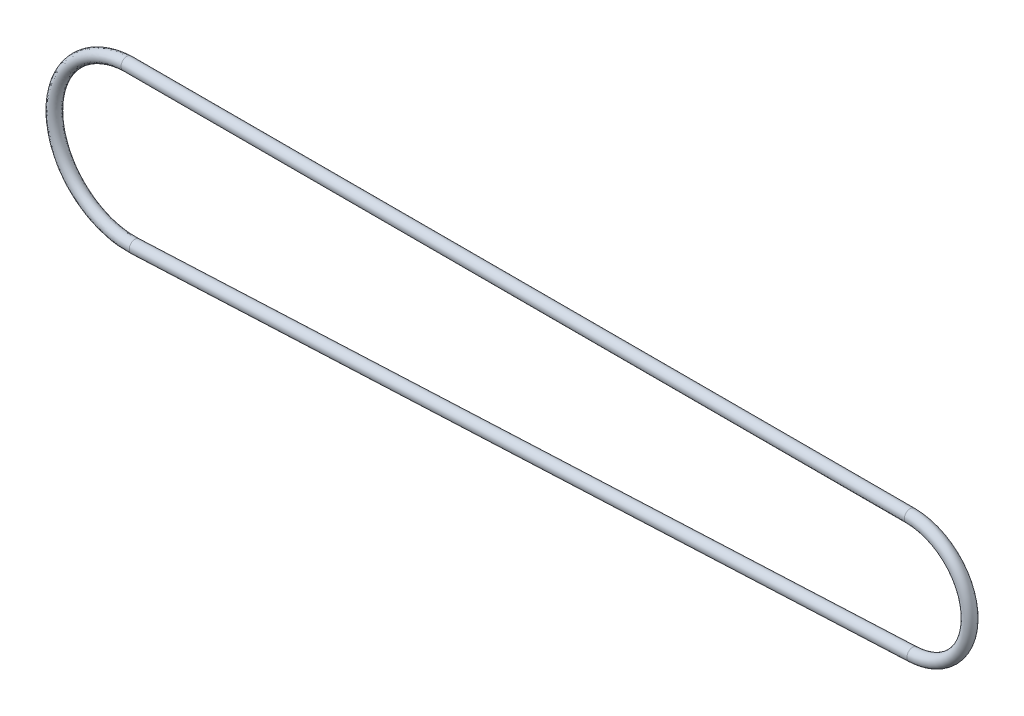
ISO-10303-21;
HEADER;
FILE_DESCRIPTION(('STEP AP214'),'2;1');
FILE_NAME('part.step','',(''),(''),'','','');
FILE_SCHEMA(('AUTOMOTIVE_DESIGN { 1 0 10303 214 1 1 1 1 }'));
ENDSEC;
DATA;
#1=APPLICATION_CONTEXT('core data for automotive mechanical design processes');
#2=APPLICATION_PROTOCOL_DEFINITION('international standard','automotive_design',2000,#1);
#3=PRODUCT_CONTEXT('',#1,'mechanical');
#4=PRODUCT('Part','Part','',(#3));
#5=PRODUCT_RELATED_PRODUCT_CATEGORY('part','',(#4));
#6=PRODUCT_DEFINITION_FORMATION('','',#4);
#7=PRODUCT_DEFINITION_CONTEXT('part definition',#1,'design');
#8=PRODUCT_DEFINITION('design','',#6,#7);
#9=PRODUCT_DEFINITION_SHAPE('','',#8);
#10=(LENGTH_UNIT() NAMED_UNIT(*) SI_UNIT(.MILLI.,.METRE.));
#11=(NAMED_UNIT(*) PLANE_ANGLE_UNIT() SI_UNIT($,.RADIAN.));
#12=(NAMED_UNIT(*) SI_UNIT($,.STERADIAN.) SOLID_ANGLE_UNIT());
#13=UNCERTAINTY_MEASURE_WITH_UNIT(LENGTH_MEASURE(1.E-05),#10,'distance_accuracy_value','');
#14=(GEOMETRIC_REPRESENTATION_CONTEXT(3) GLOBAL_UNCERTAINTY_ASSIGNED_CONTEXT((#13)) GLOBAL_UNIT_ASSIGNED_CONTEXT((#10,
#11,#12)) REPRESENTATION_CONTEXT('',''));
#15=CARTESIAN_POINT('',(0.,0.,0.));
#16=DIRECTION('',(0.,0.,1.));
#17=DIRECTION('',(1.,0.,0.));
#18=AXIS2_PLACEMENT_3D('',#15,#16,#17);
#19=CARTESIAN_POINT('',(131.418390617628,-7.01317731474051,0.));
#20=DIRECTION('',(-0.998959277745825,-0.0456109790021988,0.));
#21=DIRECTION('',(0.0456109790021988,-0.998959277745825,0.));
#22=AXIS2_PLACEMENT_3D('',#19,#20,#21);
#23=CYLINDRICAL_SURFACE('',#22,1.);
#24=CARTESIAN_POINT('',(131.418390617628,-7.01317731474051,0.));
#25=DIRECTION('',(-0.998959277745825,-0.0456109790021977,0.));
#26=DIRECTION('',(0.0456109790021977,-0.998959277745825,0.));
#27=AXIS2_PLACEMENT_3D('',#24,#25,#26);
#28=CIRCLE('',#27,1.);
#29=CARTESIAN_POINT('',(131.464001596631,-8.01213659248634,0.));
#30=VERTEX_POINT('',#29);
#31=EDGE_CURVE('E51',#30,#30,#28,.T.);
#32=ORIENTED_EDGE('',*,*,#31,.T.);
#33=EDGE_LOOP('',(#32));
#34=FACE_BOUND('',#33,.T.);
#35=CARTESIAN_POINT('',(0.592942727028589,-12.9864706106957,0.));
#36=DIRECTION('',(-0.998959277745825,-0.0456109790021977,0.));
#37=DIRECTION('',(0.0456109790021977,-0.998959277745825,0.));
#38=AXIS2_PLACEMENT_3D('',#35,#36,#37);
#39=CIRCLE('',#38,1.);
#40=CARTESIAN_POINT('',(0.638553706030787,-13.9854298884416,0.));
#41=VERTEX_POINT('',#40);
#42=EDGE_CURVE('E12',#41,#41,#39,.T.);
#43=ORIENTED_EDGE('',*,*,#42,.F.);
#44=EDGE_LOOP('',(#43));
#45=FACE_BOUND('',#44,.T.);
#46=ADVANCED_FACE('F43',(#34,#45),#23,.T.);
#47=CARTESIAN_POINT('',(130.962280827606,2.97641546271774,0.));
#48=DIRECTION('',(0.,0.,-1.));
#49=DIRECTION('',(-1.,0.,0.));
#50=AXIS2_PLACEMENT_3D('',#47,#48,#49);
#51=TOROIDAL_SURFACE('',#50,10.,1.);
#52=CARTESIAN_POINT('',(130.962280827606,12.9764154627177,0.));
#53=DIRECTION('',(1.,0.,0.));
#54=DIRECTION('',(0.,1.,0.));
#55=AXIS2_PLACEMENT_3D('',#52,#53,#54);
#56=CIRCLE('',#55,1.);
#57=CARTESIAN_POINT('',(130.962280827606,13.9764154627177,0.));
#58=VERTEX_POINT('',#57);
#59=EDGE_CURVE('E69',#58,#58,#56,.T.);
#60=CARTESIAN_POINT('',(130.962280827606,2.97641546271774,0.));
#61=DIRECTION('',(0.,0.,-1.));
#62=DIRECTION('',(-1.,0.,0.));
#63=AXIS2_PLACEMENT_3D('',#60,#61,#62);
#64=CIRCLE('',#63,11.);
#65=EDGE_CURVE('',#58,#30,#64,.T.);
#66=ORIENTED_EDGE('',*,*,#59,.T.);
#67=ORIENTED_EDGE('',*,*,#31,.F.);
#68=ORIENTED_EDGE('',*,*,#65,.T.);
#69=ORIENTED_EDGE('',*,*,#65,.F.);
#70=EDGE_LOOP('',(#66,#68,#67,#69));
#71=FACE_BOUND('',#70,.T.);
#72=ADVANCED_FACE('F77',(#71),#51,.T.);
#73=CARTESIAN_POINT('',(130.962280827606,12.9764154627177,0.));
#74=DIRECTION('',(-1.,0.,0.));
#75=DIRECTION('',(0.,-1.,0.));
#76=AXIS2_PLACEMENT_3D('',#73,#74,#75);
#77=CYLINDRICAL_SURFACE('',#76,1.);
#78=ORIENTED_EDGE('',*,*,#59,.F.);
#79=EDGE_LOOP('',(#78));
#80=FACE_BOUND('',#79,.T.);
#81=CARTESIAN_POINT('',(-0.782714340573865,12.9764154627177,0.));
#82=DIRECTION('',(-0.999546348306181,-0.0301180608236869,0.));
#83=DIRECTION('',(-0.0301180608236869,0.999546348306181,0.));
#84=AXIS2_PLACEMENT_3D('',#81,#82,#83);
#85=ELLIPSE('',#84,1.00045385758708,1.);
#86=CARTESIAN_POINT('',(-0.812846070707972,13.9764154627177,0.));
#87=VERTEX_POINT('',#86);
#88=CARTESIAN_POINT('',(-0.782714340573865,12.9764154627177,-1.));
#89=VERTEX_POINT('',#88);
#90=EDGE_CURVE('E64',#87,#89,#85,.T.);
#91=ORIENTED_EDGE('',*,*,#90,.F.);
#92=CARTESIAN_POINT('',(-0.782714340573872,12.9764154627177,1.));
#93=VERTEX_POINT('',#92);
#94=EDGE_CURVE('E58',#93,#87,#85,.T.);
#95=ORIENTED_EDGE('',*,*,#94,.F.);
#96=EDGE_CURVE('E61',#89,#93,#85,.T.);
#97=ORIENTED_EDGE('',*,*,#96,.F.);
#98=EDGE_LOOP('',(#91,#95,#97));
#99=FACE_BOUND('',#98,.T.);
#100=ADVANCED_FACE('F65',(#80,#99),#77,.T.);
#101=CARTESIAN_POINT('',(0.638553706030778,-13.9854298884416,0.));
#102=CARTESIAN_POINT('',(0.0625072309602517,-14.0117313045894,0.));
#103=CARTESIAN_POINT('',(-1.33315406208818,-13.9885134591876,0.));
#104=CARTESIAN_POINT('',(-3.39557338735128,-13.6410346123069,0.));
#105=CARTESIAN_POINT('',(-5.66701900148279,-12.8855613333339,0.));
#106=CARTESIAN_POINT('',(-7.82058321433022,-11.7016511647561,0.));
#107=CARTESIAN_POINT('',(-9.7564558145677,-10.1315173899276,0.));
#108=CARTESIAN_POINT('',(-11.3923051216876,-8.27034511831282,0.));
#109=CARTESIAN_POINT('',(-12.7346839517434,-6.01454732867633,0.));
#110=CARTESIAN_POINT('',(-13.6481494560225,-3.46712872056277,0.));
#111=CARTESIAN_POINT('',(-14.0771980762813,-0.730696427981217,0.));
#112=CARTESIAN_POINT('',(-13.9336758552197,2.03543387856783,0.));
#113=CARTESIAN_POINT('',(-13.2891153094699,4.66380794447291,0.));
#114=CARTESIAN_POINT('',(-12.1872714283067,7.04636666094951,0.));
#115=CARTESIAN_POINT('',(-10.7530275460037,9.06698526457099,0.));
#116=CARTESIAN_POINT('',(-8.99007709476819,10.8290575660817,0.));
#117=CARTESIAN_POINT('',(-6.97067519828192,12.2296646496333,0.));
#118=CARTESIAN_POINT('',(-4.78963289153586,13.2159865341036,0.));
#119=CARTESIAN_POINT('',(-2.77432299433631,13.7759833552004,0.));
#120=CARTESIAN_POINT('',(-1.38844794849952,13.9416961794532,0.));
#121=CARTESIAN_POINT('',(-0.812846070707972,13.9764154627177,0.));
#122=CARTESIAN_POINT('',(0.638553706030778,-13.9854298884416,2.));
#123=CARTESIAN_POINT('',(0.197029292798947,-14.0055892294573,2.));
#124=CARTESIAN_POINT('',(-1.40364803847922,-13.991732108185,2.));
#125=CARTESIAN_POINT('',(-3.37297414619628,-13.6400027649235,2.));
#126=CARTESIAN_POINT('',(-5.67421582635314,-12.8858899295527,2.));
#127=CARTESIAN_POINT('',(-7.81884430719966,-11.7015717688174,2.));
#128=CARTESIAN_POINT('',(-9.75692814423464,-10.1315389559655,2.));
#129=CARTESIAN_POINT('',(-11.3921671071989,-8.27033881605517,2.));
#130=CARTESIAN_POINT('',(-12.7347235697368,-6.01454914048523,2.));
#131=CARTESIAN_POINT('',(-13.6481377249932,-3.4671281735432,2.));
#132=CARTESIAN_POINT('',(-14.077203993823,-0.73069674152561,2.));
#133=CARTESIAN_POINT('',(-13.9336641318921,2.03543457429109,2.));
#134=CARTESIAN_POINT('',(-13.2891548977823,4.66380555948929,2.));
#135=CARTESIAN_POINT('',(-12.1871335181067,7.0463749787238,2.));
#136=CARTESIAN_POINT('',(-10.7534995186917,9.06695679619197,2.));
#137=CARTESIAN_POINT('',(-8.98833950129096,10.829162374582,2.));
#138=CARTESIAN_POINT('',(-6.97786659020192,12.2292308776547,2.));
#139=CARTESIAN_POINT('',(-4.76705070056446,13.2173486517644,2.));
#140=CARTESIAN_POINT('',(-2.84476381663176,13.7717344898707,2.));
#141=CARTESIAN_POINT('',(-1.25402725837905,13.949804196812,2.));
#142=CARTESIAN_POINT('',(-0.812846070707972,13.9764154627177,2.));
#143=CARTESIAN_POINT('',(0.547331748026382,-11.9875113329499,2.));
#144=CARTESIAN_POINT('',(0.105807334794552,-12.0076706739656,2.));
#145=CARTESIAN_POINT('',(-1.16647936187346,-11.9917317045993,2.));
#146=CARTESIAN_POINT('',(-2.8955025655346,-11.6932356711461,2.));
#147=CARTESIAN_POINT('',(-4.85153431353148,-11.0486681829072,2.));
#148=CARTESIAN_POINT('',(-6.69301815364289,-10.0359951344265,2.));
#149=CARTESIAN_POINT('',(-8.34916306782636,-8.69695591177432,2.));
#150=CARTESIAN_POINT('',(-9.75687022452019,-7.09869407736479,2.));
#151=CARTESIAN_POINT('',(-10.9011272250298,-5.18463628290601,2.));
#152=CARTESIAN_POINT('',(-11.6932407801404,-2.98965528518005,2.));
#153=CARTESIAN_POINT('',(-12.0639894147177,-0.654406922084017,2.));
#154=CARTESIAN_POINT('',(-11.9481391340828,1.70726157375329,2.));
#155=CARTESIAN_POINT('',(-11.3978202116569,3.97497096386715,2.));
#156=CARTESIAN_POINT('',(-10.4675983649298,6.00169280001189,2.));
#157=CARTESIAN_POINT('',(-9.24090090448408,7.74276392778578,2.));
#158=CARTESIAN_POINT('',(-7.73937086610701,9.25316002966005,2.));
#159=CARTESIAN_POINT('',(-6.01821632933816,10.4590109665996,2.));
#160=CARTESIAN_POINT('',(-4.14340061929044,11.3116265024389,2.));
#161=CARTESIAN_POINT('',(-2.45675935640214,11.7946459320794,2.));
#162=CARTESIAN_POINT('',(-1.19376379811085,11.949804196812,2.));
#163=CARTESIAN_POINT('',(-0.752582610439772,11.9764154627177,2.));
#164=CARTESIAN_POINT('',(0.547331748026382,-11.9875113329499,0.));
#165=CARTESIAN_POINT('',(0.038546303875204,-12.0107417115317,0.));
#166=CARTESIAN_POINT('',(-1.13123237367794,-11.9901223801006,0.));
#167=CARTESIAN_POINT('',(-2.9068021861121,-11.6937515948378,0.));
#168=CARTESIAN_POINT('',(-4.84793590109631,-11.0485038847978,0.));
#169=CARTESIAN_POINT('',(-6.69388760720818,-10.0360348323958,0.));
#170=CARTESIAN_POINT('',(-8.34892690299288,-8.69694512875534,0.));
#171=CARTESIAN_POINT('',(-9.75693923176454,-7.09869722849361,0.));
#172=CARTESIAN_POINT('',(-10.9011074160331,-5.18463537700156,0.));
#173=CARTESIAN_POINT('',(-11.6932466456551,-2.98965555868984,0.));
#174=CARTESIAN_POINT('',(-12.0639864559468,-0.654406765311821,0.));
#175=CARTESIAN_POINT('',(-11.9481449957466,1.70726122589166,0.));
#176=CARTESIAN_POINT('',(-11.3978004175007,3.97497215635896,0.));
#177=CARTESIAN_POINT('',(-10.4676673200298,6.00168864112474,0.));
#178=CARTESIAN_POINT('',(-9.24066491814009,7.7427781619753,0.));
#179=CARTESIAN_POINT('',(-7.74023966284562,9.25310762540991,0.));
#180=CARTESIAN_POINT('',(-6.01462063337816,10.459227852589,0.));
#181=CARTESIAN_POINT('',(-4.15469171477614,11.3109454436085,0.));
#182=CARTESIAN_POINT('',(-2.42153894525442,11.7967703647443,0.));
#183=CARTESIAN_POINT('',(-1.26097414317109,11.9457501881326,0.));
#184=CARTESIAN_POINT('',(-0.752582610439772,11.9764154627177,0.));
#185=CARTESIAN_POINT('',(0.547331748026382,-11.9875113329499,-2.));
#186=CARTESIAN_POINT('',(-0.0287147270441437,-12.0138127490977,-2.));
#187=CARTESIAN_POINT('',(-1.09598538548242,-11.988513055602,-2.));
#188=CARTESIAN_POINT('',(-2.9181018066896,-11.6942675185295,-2.));
#189=CARTESIAN_POINT('',(-4.84433748866114,-11.0483395866884,-2.));
#190=CARTESIAN_POINT('',(-6.69475706077346,-10.0360745303652,-2.));
#191=CARTESIAN_POINT('',(-8.3486907381594,-8.69693434573635,-2.));
#192=CARTESIAN_POINT('',(-9.75700823900888,-7.09870037962244,-2.));
#193=CARTESIAN_POINT('',(-10.9010876070365,-5.18463447109711,-2.));
#194=CARTESIAN_POINT('',(-11.6932525111698,-2.98965583219962,-2.));
#195=CARTESIAN_POINT('',(-12.063983497176,-0.654406608539624,-2.));
#196=CARTESIAN_POINT('',(-11.9481508574104,1.70726087803003,-2.));
#197=CARTESIAN_POINT('',(-11.3977806233445,3.97497334885078,-2.));
#198=CARTESIAN_POINT('',(-10.4677362751299,6.00168448223759,-2.));
#199=CARTESIAN_POINT('',(-9.24042893179609,7.74279239616481,-2.));
#200=CARTESIAN_POINT('',(-7.74110845958423,9.25305522115977,-2.));
#201=CARTESIAN_POINT('',(-6.01102493741816,10.4594447385783,-2.));
#202=CARTESIAN_POINT('',(-4.16598281026184,11.3102643847781,-2.));
#203=CARTESIAN_POINT('',(-2.3863185341067,11.7988947974091,-2.));
#204=CARTESIAN_POINT('',(-1.32818448823132,11.9416961794532,-2.));
#205=CARTESIAN_POINT('',(-0.752582610439772,11.9764154627177,-2.));
#206=CARTESIAN_POINT('',(0.638553706030778,-13.9854298884416,-2.));
#207=CARTESIAN_POINT('',(-0.0720148308784439,-14.0178733797215,-2.));
#208=CARTESIAN_POINT('',(-1.26266008569714,-13.9852948101903,-2.));
#209=CARTESIAN_POINT('',(-3.41817262850629,-13.6420664596902,-2.));
#210=CARTESIAN_POINT('',(-5.65982217661245,-12.8852327371151,-2.));
#211=CARTESIAN_POINT('',(-7.82232212146079,-11.7017305606949,-2.));
#212=CARTESIAN_POINT('',(-9.75598348490074,-10.1314958238896,-2.));
#213=CARTESIAN_POINT('',(-11.3924431361763,-8.27035142057046,-2.));
#214=CARTESIAN_POINT('',(-12.7346443337501,-6.01454551686743,-2.));
#215=CARTESIAN_POINT('',(-13.6481611870518,-3.46712926758234,-2.));
#216=CARTESIAN_POINT('',(-14.0771921587396,-0.730696114436824,-2.));
#217=CARTESIAN_POINT('',(-13.9336875785474,2.03543318284458,-2.));
#218=CARTESIAN_POINT('',(-13.2890757211575,4.66381032945654,-2.));
#219=CARTESIAN_POINT('',(-12.1874093385068,7.04635834317521,-2.));
#220=CARTESIAN_POINT('',(-10.7525555733158,9.06701373295002,-2.));
#221=CARTESIAN_POINT('',(-8.99181468824541,10.8289527575814,-2.));
#222=CARTESIAN_POINT('',(-6.96348380636192,12.2300984216119,-2.));
#223=CARTESIAN_POINT('',(-4.81221508250727,13.2146244164428,-2.));
#224=CARTESIAN_POINT('',(-2.70388217204086,13.7802322205301,-2.));
#225=CARTESIAN_POINT('',(-1.52286863861999,13.9335881620943,-2.));
#226=CARTESIAN_POINT('',(-0.812846070707972,13.9764154627177,-2.));
#227=CARTESIAN_POINT('',(0.638553706030778,-13.9854298884416,0.));
#228=CARTESIAN_POINT('',(0.0625072309602517,-14.0117313045894,0.));
#229=CARTESIAN_POINT('',(-1.33315406208818,-13.9885134591876,0.));
#230=CARTESIAN_POINT('',(-3.39557338735128,-13.6410346123069,0.));
#231=CARTESIAN_POINT('',(-5.66701900148279,-12.8855613333339,0.));
#232=CARTESIAN_POINT('',(-7.82058321433022,-11.7016511647561,0.));
#233=CARTESIAN_POINT('',(-9.7564558145677,-10.1315173899276,0.));
#234=CARTESIAN_POINT('',(-11.3923051216876,-8.27034511831282,0.));
#235=CARTESIAN_POINT('',(-12.7346839517434,-6.01454732867633,0.));
#236=CARTESIAN_POINT('',(-13.6481494560225,-3.46712872056277,0.));
#237=CARTESIAN_POINT('',(-14.0771980762813,-0.730696427981217,0.));
#238=CARTESIAN_POINT('',(-13.9336758552197,2.03543387856783,0.));
#239=CARTESIAN_POINT('',(-13.2891153094699,4.66380794447291,0.));
#240=CARTESIAN_POINT('',(-12.1872714283067,7.04636666094951,0.));
#241=CARTESIAN_POINT('',(-10.7530275460037,9.06698526457099,0.));
#242=CARTESIAN_POINT('',(-8.99007709476819,10.8290575660817,0.));
#243=CARTESIAN_POINT('',(-6.97067519828192,12.2296646496333,0.));
#244=CARTESIAN_POINT('',(-4.78963289153586,13.2159865341036,0.));
#245=CARTESIAN_POINT('',(-2.77432299433631,13.7759833552004,0.));
#246=CARTESIAN_POINT('',(-1.38844794849952,13.9416961794532,0.));
#247=CARTESIAN_POINT('',(-0.812846070707972,13.9764154627177,0.));
#248=(BOUNDED_SURFACE() B_SPLINE_SURFACE(3,3,((#101,#102,#103,#104,#105,#106,#107,#108,#109,
#110,#111,#112,#113,#114,#115,#116,#117,#118,#119,#120,#121),(#122,#123,#124,#125,#126,#127,
#128,#129,#130,#131,#132,#133,#134,#135,#136,#137,#138,#139,#140,#141,#142),(#143,#144,#145,
#146,#147,#148,#149,#150,#151,#152,#153,#154,#155,#156,#157,#158,#159,#160,#161,#162,#163),
(#164,#165,#166,#167,#168,#169,#170,#171,#172,#173,#174,#175,#176,#177,#178,#179,#180,#181,#182,
#183,#184),(#185,#186,#187,#188,#189,#190,#191,#192,#193,#194,#195,#196,#197,#198,#199,#200,
#201,#202,#203,#204,#205),(#206,#207,#208,#209,#210,#211,#212,#213,#214,#215,#216,#217,#218,
#219,#220,#221,#222,#223,#224,#225,#226),(#227,#228,#229,#230,#231,#232,#233,#234,#235,#236,
#237,#238,#239,#240,#241,#242,#243,#244,#245,#246,#247)),.UNSPECIFIED.,.T.,.F.,
.F.) B_SPLINE_SURFACE_WITH_KNOTS((4,3,4),(4,1,1,1,1,1,1,1,1,1,1,1,1,1,1,1,1,1,4),(0.,0.5,1.),
(0.,0.0426165654579045,0.0907152651902475,0.144951131416528,0.205378127894143,0.258391993371407,
0.314972171052375,0.374724450030499,0.436785716221633,0.49999967432623,0.563213653909842,
0.625274943532396,0.685027271592809,0.741607510726974,0.79462144379722,0.855048539943225,
0.909284513668706,0.957383320611568,1.),
.UNSPECIFIED.) GEOMETRIC_REPRESENTATION_ITEM() RATIONAL_B_SPLINE_SURFACE(((1.,1.,1.,1.,1.,1.,1.,
1.,1.,1.,1.,1.,1.,0.999999999999999,1.,1.,1.,1.,1.,1.,1.),(0.333333333333333,0.333333333333333,
0.333333333333333,0.333333333333333,0.333333333333333,0.333333333333333,0.333333333333333,
0.333333333333333,0.333333333333333,0.333333333333333,0.333333333333333,0.333333333333333,
0.333333333333333,0.333333333333333,0.333333333333334,0.333333333333333,0.333333333333333,
0.333333333333333,0.333333333333333,0.333333333333333,0.333333333333333),(0.333333333333333,
0.333333333333333,0.333333333333333,0.333333333333333,0.333333333333333,0.333333333333333,
0.333333333333333,0.333333333333333,0.333333333333333,0.333333333333333,0.333333333333333,
0.333333333333333,0.333333333333333,0.333333333333333,0.333333333333334,0.333333333333333,
0.333333333333333,0.333333333333333,0.333333333333333,0.333333333333333,0.333333333333333),(1.,
1.,1.,1.,1.,1.,1.,1.,1.,1.,1.,1.,1.,0.999999999999999,1.,1.,1.,1.,1.,1.,1.),(0.333333333333333,
0.333333333333333,0.333333333333333,0.333333333333333,0.333333333333333,0.333333333333333,
0.333333333333333,0.333333333333333,0.333333333333333,0.333333333333333,0.333333333333333,
0.333333333333333,0.333333333333333,0.333333333333333,0.333333333333334,0.333333333333333,
0.333333333333333,0.333333333333333,0.333333333333333,0.333333333333333,0.333333333333333),
(0.333333333333333,0.333333333333333,0.333333333333333,0.333333333333333,0.333333333333333,
0.333333333333333,0.333333333333333,0.333333333333333,0.333333333333333,0.333333333333333,
0.333333333333333,0.333333333333333,0.333333333333333,0.333333333333333,0.333333333333334,
0.333333333333333,0.333333333333333,0.333333333333333,0.333333333333333,0.333333333333333,
0.333333333333333),(1.,1.,1.,1.,1.,1.,1.,1.,1.,1.,1.,1.,1.,0.999999999999999,1.,1.,1.,1.,1.,1.,1.))) REPRESENTATION_ITEM('') SURFACE());
#249=ORIENTED_EDGE('',*,*,#42,.T.);
#250=EDGE_LOOP('',(#249));
#251=FACE_BOUND('',#250,.T.);
#252=ORIENTED_EDGE('',*,*,#90,.T.);
#253=ORIENTED_EDGE('',*,*,#96,.T.);
#254=ORIENTED_EDGE('',*,*,#94,.T.);
#255=EDGE_LOOP('',(#252,#253,#254));
#256=FACE_BOUND('',#255,.T.);
#257=ADVANCED_FACE('F68',(#251,#256),#248,.T.);
#258=CLOSED_SHELL('',(#46,#72,#100,#257));
#259=MANIFOLD_SOLID_BREP('B2',#258);
#260=ADVANCED_BREP_SHAPE_REPRESENTATION('',(#18,#259),#14);
#261=SHAPE_DEFINITION_REPRESENTATION(#9,#260);
ENDSEC;
END-ISO-10303-21;
